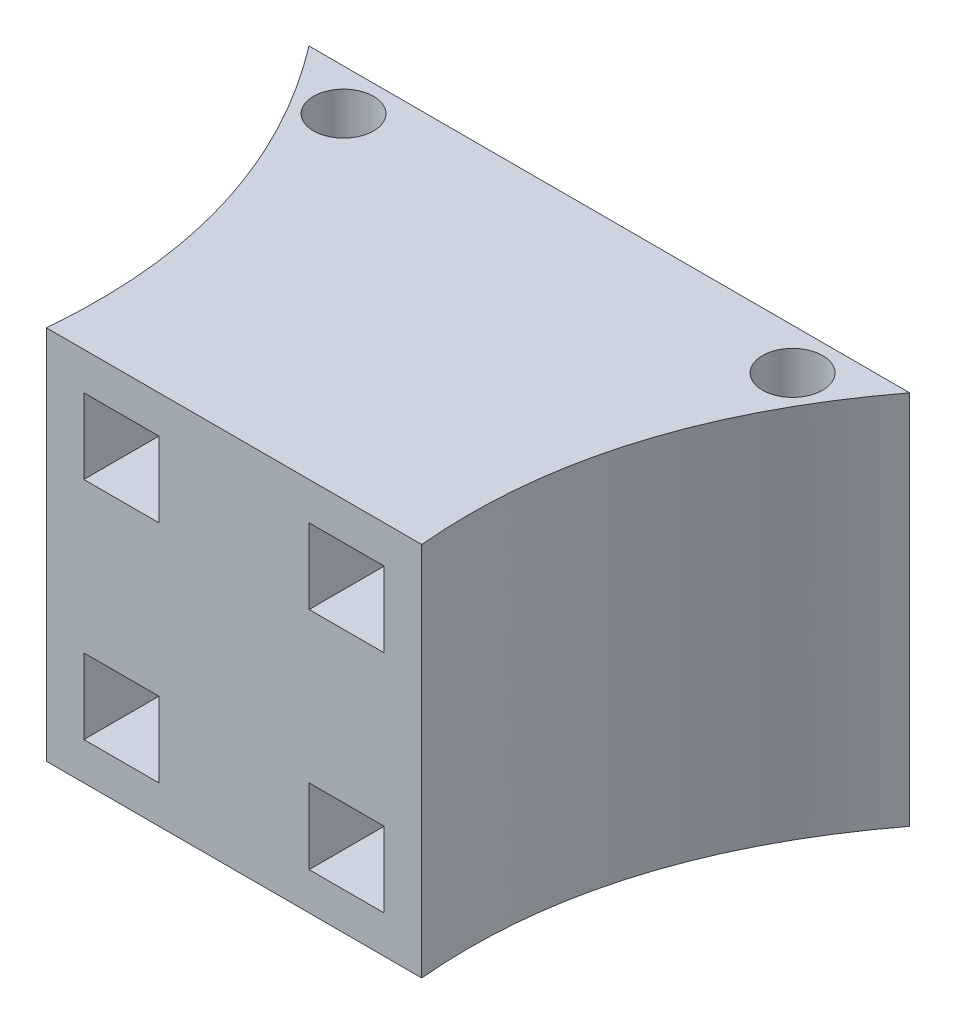
ISO-10303-21;
HEADER;
FILE_DESCRIPTION(('STEP AP214'),'2;1');
FILE_NAME('part.step','',(''),(''),'','','');
FILE_SCHEMA(('AUTOMOTIVE_DESIGN { 1 0 10303 214 1 1 1 1 }'));
ENDSEC;
DATA;
#1=APPLICATION_CONTEXT('core data for automotive mechanical design processes');
#2=APPLICATION_PROTOCOL_DEFINITION('international standard','automotive_design',2000,#1);
#3=PRODUCT_CONTEXT('',#1,'mechanical');
#4=PRODUCT('Part','Part','',(#3));
#5=PRODUCT_RELATED_PRODUCT_CATEGORY('part','',(#4));
#6=PRODUCT_DEFINITION_FORMATION('','',#4);
#7=PRODUCT_DEFINITION_CONTEXT('part definition',#1,'design');
#8=PRODUCT_DEFINITION('design','',#6,#7);
#9=PRODUCT_DEFINITION_SHAPE('','',#8);
#10=(LENGTH_UNIT() NAMED_UNIT(*) SI_UNIT(.MILLI.,.METRE.));
#11=(NAMED_UNIT(*) PLANE_ANGLE_UNIT() SI_UNIT($,.RADIAN.));
#12=(NAMED_UNIT(*) SI_UNIT($,.STERADIAN.) SOLID_ANGLE_UNIT());
#13=UNCERTAINTY_MEASURE_WITH_UNIT(LENGTH_MEASURE(1.E-05),#10,'distance_accuracy_value','');
#14=(GEOMETRIC_REPRESENTATION_CONTEXT(3) GLOBAL_UNCERTAINTY_ASSIGNED_CONTEXT((#13)) GLOBAL_UNIT_ASSIGNED_CONTEXT((#10,
#11,#12)) REPRESENTATION_CONTEXT('',''));
#15=CARTESIAN_POINT('',(0.,0.,0.));
#16=DIRECTION('',(0.,0.,1.));
#17=DIRECTION('',(1.,0.,0.));
#18=AXIS2_PLACEMENT_3D('',#15,#16,#17);
#19=CARTESIAN_POINT('',(-38.1,-127.,-126.964946797341));
#20=CARTESIAN_POINT('',(6.35973064155392,-127.,-68.4699237565732));
#21=CARTESIAN_POINT('',(0.,-127.,0.));
#22=B_SPLINE_CURVE_WITH_KNOTS('',2,(#19,#20,#21),.UNSPECIFIED.,.F.,.F.,(3,3),(0.,1.),.UNSPECIFIED.);
#23=DIRECTION('',(0.,1.,0.));
#24=VECTOR('',#23,1.);
#25=SURFACE_OF_LINEAR_EXTRUSION('',#22,#24);
#26=CARTESIAN_POINT('',(-38.1,0.,-126.964946797341));
#27=CARTESIAN_POINT('',(6.35973064155392,0.,-68.4699237565732));
#28=CARTESIAN_POINT('',(0.,0.,0.));
#29=B_SPLINE_CURVE_WITH_KNOTS('',2,(#26,#27,#28),.UNSPECIFIED.,.F.,.F.,(3,3),(0.,1.),.UNSPECIFIED.);
#30=CARTESIAN_POINT('',(-38.1,0.,-126.964946797341));
#31=VERTEX_POINT('',#30);
#32=CARTESIAN_POINT('',(0.,0.,0.));
#33=VERTEX_POINT('',#32);
#34=EDGE_CURVE('E302',#31,#33,#29,.T.);
#35=ORIENTED_EDGE('',*,*,#34,.F.);
#36=DIRECTION('',(0.,1.,0.));
#37=VECTOR('',#36,1.);
#38=CARTESIAN_POINT('',(-38.1,-127.,-126.964946797341));
#39=LINE('',#38,#37);
#40=CARTESIAN_POINT('',(-38.1,-127.,-126.964946797341));
#41=VERTEX_POINT('',#40);
#42=EDGE_CURVE('E11',#41,#31,#39,.T.);
#43=ORIENTED_EDGE('',*,*,#42,.F.);
#44=CARTESIAN_POINT('',(0.,-127.,0.));
#45=VERTEX_POINT('',#44);
#46=EDGE_CURVE('E308',#41,#45,#22,.T.);
#47=ORIENTED_EDGE('',*,*,#46,.T.);
#48=DIRECTION('',(0.,1.,0.));
#49=VECTOR('',#48,1.);
#50=CARTESIAN_POINT('',(0.,-127.,0.));
#51=LINE('',#50,#49);
#52=EDGE_CURVE('E36',#45,#33,#51,.T.);
#53=ORIENTED_EDGE('',*,*,#52,.T.);
#54=EDGE_LOOP('',(#35,#43,#47,#53));
#55=FACE_BOUND('',#54,.T.);
#56=ADVANCED_FACE('F32',(#55),#25,.T.);
#57=CARTESIAN_POINT('',(165.1,-127.,-126.964946797341));
#58=DIRECTION('',(0.,0.,-1.));
#59=DIRECTION('',(-1.,0.,0.));
#60=AXIS2_PLACEMENT_3D('',#57,#58,#59);
#61=PLANE('',#60);
#62=DIRECTION('',(-1.,0.,0.));
#63=VECTOR('',#62,1.);
#64=CARTESIAN_POINT('',(165.1,0.,-126.964946797341));
#65=LINE('',#64,#63);
#66=CARTESIAN_POINT('',(165.1,0.,-126.964946797341));
#67=VERTEX_POINT('',#66);
#68=EDGE_CURVE('E315',#67,#31,#65,.T.);
#69=ORIENTED_EDGE('',*,*,#68,.F.);
#70=DIRECTION('',(0.,1.,0.));
#71=VECTOR('',#70,1.);
#72=CARTESIAN_POINT('',(165.1,-127.,-126.964946797341));
#73=LINE('',#72,#71);
#74=CARTESIAN_POINT('',(165.1,-127.,-126.964946797341));
#75=VERTEX_POINT('',#74);
#76=EDGE_CURVE('E41',#75,#67,#73,.T.);
#77=ORIENTED_EDGE('',*,*,#76,.F.);
#78=DIRECTION('',(-1.,0.,0.));
#79=VECTOR('',#78,1.);
#80=CARTESIAN_POINT('',(165.1,-127.,-126.964946797341));
#81=LINE('',#80,#79);
#82=EDGE_CURVE('E327',#75,#41,#81,.T.);
#83=ORIENTED_EDGE('',*,*,#82,.T.);
#84=ORIENTED_EDGE('',*,*,#42,.T.);
#85=EDGE_LOOP('',(#69,#77,#83,#84));
#86=FACE_BOUND('',#85,.T.);
#87=ADVANCED_FACE('F337',(#86),#61,.T.);
#88=CARTESIAN_POINT('',(127.,-127.,0.));
#89=CARTESIAN_POINT('',(120.64028038654,-127.,-68.4699193864039));
#90=CARTESIAN_POINT('',(165.1,-127.,-126.964946797341));
#91=B_SPLINE_CURVE_WITH_KNOTS('',2,(#88,#89,#90),.UNSPECIFIED.,.F.,.F.,(3,3),(0.,1.),.UNSPECIFIED.);
#92=DIRECTION('',(0.,1.,0.));
#93=VECTOR('',#92,1.);
#94=SURFACE_OF_LINEAR_EXTRUSION('',#91,#93);
#95=CARTESIAN_POINT('',(127.,0.,0.));
#96=CARTESIAN_POINT('',(120.64028038654,0.,-68.4699193864039));
#97=CARTESIAN_POINT('',(165.1,0.,-126.964946797341));
#98=B_SPLINE_CURVE_WITH_KNOTS('',2,(#95,#96,#97),.UNSPECIFIED.,.F.,.F.,(3,3),(0.,1.),.UNSPECIFIED.);
#99=CARTESIAN_POINT('',(127.,0.,0.));
#100=VERTEX_POINT('',#99);
#101=EDGE_CURVE('E367',#100,#67,#98,.T.);
#102=ORIENTED_EDGE('',*,*,#101,.F.);
#103=DIRECTION('',(0.,1.,0.));
#104=VECTOR('',#103,1.);
#105=CARTESIAN_POINT('',(127.,-127.,0.));
#106=LINE('',#105,#104);
#107=CARTESIAN_POINT('',(127.,-127.,0.));
#108=VERTEX_POINT('',#107);
#109=EDGE_CURVE('E374',#108,#100,#106,.T.);
#110=ORIENTED_EDGE('',*,*,#109,.F.);
#111=EDGE_CURVE('E321',#108,#75,#91,.T.);
#112=ORIENTED_EDGE('',*,*,#111,.T.);
#113=ORIENTED_EDGE('',*,*,#76,.T.);
#114=EDGE_LOOP('',(#102,#110,#112,#113));
#115=FACE_BOUND('',#114,.T.);
#116=ADVANCED_FACE('F333',(#115),#94,.T.);
#117=CARTESIAN_POINT('',(0.,-127.,0.));
#118=DIRECTION('',(0.,0.,1.));
#119=DIRECTION('',(1.,0.,0.));
#120=AXIS2_PLACEMENT_3D('',#117,#118,#119);
#121=PLANE('',#120);
#122=DIRECTION('',(0.,1.,0.));
#123=VECTOR('',#122,1.);
#124=CARTESIAN_POINT('',(38.1,-88.9,0.));
#125=LINE('',#124,#123);
#126=CARTESIAN_POINT('',(38.1,-114.3,0.));
#127=VERTEX_POINT('',#126);
#128=CARTESIAN_POINT('',(38.1,-88.9,0.));
#129=VERTEX_POINT('',#128);
#130=EDGE_CURVE('E49',#127,#129,#125,.T.);
#131=ORIENTED_EDGE('',*,*,#130,.F.);
#132=DIRECTION('',(1.,0.,0.));
#133=VECTOR('',#132,1.);
#134=CARTESIAN_POINT('',(38.1,-114.3,0.));
#135=LINE('',#134,#133);
#136=CARTESIAN_POINT('',(12.7,-114.3,0.));
#137=VERTEX_POINT('',#136);
#138=EDGE_CURVE('E220',#137,#127,#135,.T.);
#139=ORIENTED_EDGE('',*,*,#138,.F.);
#140=DIRECTION('',(0.,-1.,0.));
#141=VECTOR('',#140,1.);
#142=CARTESIAN_POINT('',(12.7,-88.9,0.));
#143=LINE('',#142,#141);
#144=CARTESIAN_POINT('',(12.7,-88.9,0.));
#145=VERTEX_POINT('',#144);
#146=EDGE_CURVE('E235',#145,#137,#143,.T.);
#147=ORIENTED_EDGE('',*,*,#146,.F.);
#148=DIRECTION('',(-1.,0.,0.));
#149=VECTOR('',#148,1.);
#150=CARTESIAN_POINT('',(38.1,-88.9,0.));
#151=LINE('',#150,#149);
#152=EDGE_CURVE('E231',#129,#145,#151,.T.);
#153=ORIENTED_EDGE('',*,*,#152,.F.);
#154=EDGE_LOOP('',(#131,#139,#147,#153));
#155=FACE_BOUND('',#154,.T.);
#156=DIRECTION('',(0.,-1.,0.));
#157=VECTOR('',#156,1.);
#158=CARTESIAN_POINT('',(88.9,-12.7,0.));
#159=LINE('',#158,#157);
#160=CARTESIAN_POINT('',(88.9,-12.7,0.));
#161=VERTEX_POINT('',#160);
#162=CARTESIAN_POINT('',(88.9,-38.1,0.));
#163=VERTEX_POINT('',#162);
#164=EDGE_CURVE('E57',#161,#163,#159,.T.);
#165=ORIENTED_EDGE('',*,*,#164,.F.);
#166=DIRECTION('',(-1.,0.,0.));
#167=VECTOR('',#166,1.);
#168=CARTESIAN_POINT('',(88.9,-12.7,0.));
#169=LINE('',#168,#167);
#170=CARTESIAN_POINT('',(114.3,-12.7,0.));
#171=VERTEX_POINT('',#170);
#172=EDGE_CURVE('E252',#171,#161,#169,.T.);
#173=ORIENTED_EDGE('',*,*,#172,.F.);
#174=DIRECTION('',(0.,1.,0.));
#175=VECTOR('',#174,1.);
#176=CARTESIAN_POINT('',(114.3,-12.7,0.));
#177=LINE('',#176,#175);
#178=CARTESIAN_POINT('',(114.3,-38.1,0.));
#179=VERTEX_POINT('',#178);
#180=EDGE_CURVE('E266',#179,#171,#177,.T.);
#181=ORIENTED_EDGE('',*,*,#180,.F.);
#182=DIRECTION('',(1.,0.,0.));
#183=VECTOR('',#182,1.);
#184=CARTESIAN_POINT('',(88.9,-38.1,0.));
#185=LINE('',#184,#183);
#186=EDGE_CURVE('E263',#163,#179,#185,.T.);
#187=ORIENTED_EDGE('',*,*,#186,.F.);
#188=EDGE_LOOP('',(#165,#173,#181,#187));
#189=FACE_BOUND('',#188,.T.);
#190=DIRECTION('',(0.,-1.,0.));
#191=VECTOR('',#190,1.);
#192=CARTESIAN_POINT('',(88.9,-88.9,0.));
#193=LINE('',#192,#191);
#194=CARTESIAN_POINT('',(88.9,-88.9,0.));
#195=VERTEX_POINT('',#194);
#196=CARTESIAN_POINT('',(88.9,-114.3,0.));
#197=VERTEX_POINT('',#196);
#198=EDGE_CURVE('E177',#195,#197,#193,.T.);
#199=ORIENTED_EDGE('',*,*,#198,.F.);
#200=DIRECTION('',(-1.,0.,0.));
#201=VECTOR('',#200,1.);
#202=CARTESIAN_POINT('',(88.9,-88.9,0.));
#203=LINE('',#202,#201);
#204=CARTESIAN_POINT('',(114.3,-88.9,0.));
#205=VERTEX_POINT('',#204);
#206=EDGE_CURVE('E194',#205,#195,#203,.T.);
#207=ORIENTED_EDGE('',*,*,#206,.F.);
#208=DIRECTION('',(0.,1.,0.));
#209=VECTOR('',#208,1.);
#210=CARTESIAN_POINT('',(114.3,-88.9,0.));
#211=LINE('',#210,#209);
#212=CARTESIAN_POINT('',(114.3,-114.3,0.));
#213=VERTEX_POINT('',#212);
#214=EDGE_CURVE('E197',#213,#205,#211,.T.);
#215=ORIENTED_EDGE('',*,*,#214,.F.);
#216=DIRECTION('',(1.,0.,0.));
#217=VECTOR('',#216,1.);
#218=CARTESIAN_POINT('',(88.9,-114.3,0.));
#219=LINE('',#218,#217);
#220=EDGE_CURVE('E206',#197,#213,#219,.T.);
#221=ORIENTED_EDGE('',*,*,#220,.F.);
#222=EDGE_LOOP('',(#199,#207,#215,#221));
#223=FACE_BOUND('',#222,.T.);
#224=DIRECTION('',(0.,-1.,0.));
#225=VECTOR('',#224,1.);
#226=CARTESIAN_POINT('',(12.7,-12.7,0.));
#227=LINE('',#226,#225);
#228=CARTESIAN_POINT('',(12.7,-12.7,0.));
#229=VERTEX_POINT('',#228);
#230=CARTESIAN_POINT('',(12.7,-38.1,0.));
#231=VERTEX_POINT('',#230);
#232=EDGE_CURVE('E242',#229,#231,#227,.T.);
#233=ORIENTED_EDGE('',*,*,#232,.F.);
#234=DIRECTION('',(-1.,0.,0.));
#235=VECTOR('',#234,1.);
#236=CARTESIAN_POINT('',(12.7,-12.7,0.));
#237=LINE('',#236,#235);
#238=CARTESIAN_POINT('',(38.1,-12.7,0.));
#239=VERTEX_POINT('',#238);
#240=EDGE_CURVE('E281',#239,#229,#237,.T.);
#241=ORIENTED_EDGE('',*,*,#240,.F.);
#242=DIRECTION('',(0.,1.,0.));
#243=VECTOR('',#242,1.);
#244=CARTESIAN_POINT('',(38.1,-12.7,0.));
#245=LINE('',#244,#243);
#246=CARTESIAN_POINT('',(38.1,-38.1,0.));
#247=VERTEX_POINT('',#246);
#248=EDGE_CURVE('E295',#247,#239,#245,.T.);
#249=ORIENTED_EDGE('',*,*,#248,.F.);
#250=DIRECTION('',(1.,0.,0.));
#251=VECTOR('',#250,1.);
#252=CARTESIAN_POINT('',(12.7,-38.1,0.));
#253=LINE('',#252,#251);
#254=EDGE_CURVE('E292',#231,#247,#253,.T.);
#255=ORIENTED_EDGE('',*,*,#254,.F.);
#256=EDGE_LOOP('',(#233,#241,#249,#255));
#257=FACE_BOUND('',#256,.T.);
#258=DIRECTION('',(1.,0.,0.));
#259=VECTOR('',#258,1.);
#260=CARTESIAN_POINT('',(0.,0.,0.));
#261=LINE('',#260,#259);
#262=EDGE_CURVE('E363',#33,#100,#261,.T.);
#263=ORIENTED_EDGE('',*,*,#262,.F.);
#264=ORIENTED_EDGE('',*,*,#52,.F.);
#265=DIRECTION('',(1.,0.,0.));
#266=VECTOR('',#265,1.);
#267=CARTESIAN_POINT('',(0.,-127.,0.));
#268=LINE('',#267,#266);
#269=EDGE_CURVE('E314',#45,#108,#268,.T.);
#270=ORIENTED_EDGE('',*,*,#269,.T.);
#271=ORIENTED_EDGE('',*,*,#109,.T.);
#272=EDGE_LOOP('',(#263,#264,#270,#271));
#273=FACE_BOUND('',#272,.T.);
#274=ADVANCED_FACE('F336',(#155,#189,#223,#257,#273),#121,.T.);
#275=CARTESIAN_POINT('',(-6.34513467922304,-127.,-65.9761985776217));
#276=DIRECTION('',(0.,-1.,0.));
#277=DIRECTION('',(0.,0.,-1.));
#278=AXIS2_PLACEMENT_3D('',#275,#276,#277);
#279=PLANE('',#278);
#280=CARTESIAN_POINT('',(-12.4472574565603,-127.,-112.994946797341));
#281=DIRECTION('',(0.,1.,0.));
#282=DIRECTION('',(0.,0.,1.));
#283=AXIS2_PLACEMENT_3D('',#280,#281,#282);
#284=CIRCLE('',#283,10.16);
#285=CARTESIAN_POINT('',(-12.4472574565603,-127.,-102.834946797341));
#286=VERTEX_POINT('',#285);
#287=EDGE_CURVE('E207',#286,#286,#284,.T.);
#288=ORIENTED_EDGE('',*,*,#287,.T.);
#289=EDGE_LOOP('',(#288));
#290=FACE_BOUND('',#289,.T.);
#291=CARTESIAN_POINT('',(139.44725745656,-127.,-112.994946797341));
#292=DIRECTION('',(0.,1.,0.));
#293=DIRECTION('',(0.,0.,1.));
#294=AXIS2_PLACEMENT_3D('',#291,#292,#293);
#295=CIRCLE('',#294,10.16);
#296=CARTESIAN_POINT('',(139.44725745656,-127.,-102.834946797341));
#297=VERTEX_POINT('',#296);
#298=EDGE_CURVE('E482',#297,#297,#295,.T.);
#299=ORIENTED_EDGE('',*,*,#298,.T.);
#300=EDGE_LOOP('',(#299));
#301=FACE_BOUND('',#300,.T.);
#302=ORIENTED_EDGE('',*,*,#46,.F.);
#303=ORIENTED_EDGE('',*,*,#82,.F.);
#304=ORIENTED_EDGE('',*,*,#111,.F.);
#305=ORIENTED_EDGE('',*,*,#269,.F.);
#306=EDGE_LOOP('',(#302,#303,#304,#305));
#307=FACE_BOUND('',#306,.T.);
#308=ADVANCED_FACE('F341',(#290,#301,#307),#279,.T.);
#309=CARTESIAN_POINT('',(-6.34513467922304,0.,-65.9761985776217));
#310=DIRECTION('',(0.,-1.,0.));
#311=DIRECTION('',(0.,0.,-1.));
#312=AXIS2_PLACEMENT_3D('',#309,#310,#311);
#313=PLANE('',#312);
#314=CARTESIAN_POINT('',(-12.4472574565603,0.,-112.994946797341));
#315=DIRECTION('',(0.,1.,0.));
#316=DIRECTION('',(0.,0.,1.));
#317=AXIS2_PLACEMENT_3D('',#314,#315,#316);
#318=CIRCLE('',#317,10.16);
#319=CARTESIAN_POINT('',(-12.4472574565603,0.,-102.834946797341));
#320=VERTEX_POINT('',#319);
#321=EDGE_CURVE('E481',#320,#320,#318,.T.);
#322=ORIENTED_EDGE('',*,*,#321,.F.);
#323=EDGE_LOOP('',(#322));
#324=FACE_BOUND('',#323,.T.);
#325=CARTESIAN_POINT('',(139.44725745656,0.,-112.994946797341));
#326=DIRECTION('',(0.,1.,0.));
#327=DIRECTION('',(0.,0.,1.));
#328=AXIS2_PLACEMENT_3D('',#325,#326,#327);
#329=CIRCLE('',#328,10.16);
#330=CARTESIAN_POINT('',(139.44725745656,0.,-102.834946797341));
#331=VERTEX_POINT('',#330);
#332=EDGE_CURVE('E200',#331,#331,#329,.T.);
#333=ORIENTED_EDGE('',*,*,#332,.F.);
#334=EDGE_LOOP('',(#333));
#335=FACE_BOUND('',#334,.T.);
#336=ORIENTED_EDGE('',*,*,#34,.T.);
#337=ORIENTED_EDGE('',*,*,#262,.T.);
#338=ORIENTED_EDGE('',*,*,#101,.T.);
#339=ORIENTED_EDGE('',*,*,#68,.T.);
#340=EDGE_LOOP('',(#336,#337,#338,#339));
#341=FACE_BOUND('',#340,.T.);
#342=ADVANCED_FACE('F346',(#324,#335,#341),#313,.F.);
#343=CARTESIAN_POINT('',(12.7,-12.7,-63.5));
#344=DIRECTION('',(-1.,0.,0.));
#345=DIRECTION('',(0.,-1.,0.));
#346=AXIS2_PLACEMENT_3D('',#343,#344,#345);
#347=PLANE('',#346);
#348=ORIENTED_EDGE('',*,*,#232,.T.);
#349=DIRECTION('',(0.,0.,1.));
#350=VECTOR('',#349,1.);
#351=CARTESIAN_POINT('',(12.7,-38.1,-63.5));
#352=LINE('',#351,#350);
#353=CARTESIAN_POINT('',(12.7,-38.1,-63.5));
#354=VERTEX_POINT('',#353);
#355=EDGE_CURVE('E290',#354,#231,#352,.T.);
#356=ORIENTED_EDGE('',*,*,#355,.F.);
#357=DIRECTION('',(0.,-1.,0.));
#358=VECTOR('',#357,1.);
#359=CARTESIAN_POINT('',(12.7,-12.7,-63.5));
#360=LINE('',#359,#358);
#361=CARTESIAN_POINT('',(12.7,-12.7,-63.5));
#362=VERTEX_POINT('',#361);
#363=EDGE_CURVE('E277',#362,#354,#360,.T.);
#364=ORIENTED_EDGE('',*,*,#363,.F.);
#365=DIRECTION('',(0.,0.,1.));
#366=VECTOR('',#365,1.);
#367=CARTESIAN_POINT('',(12.7,-12.7,-63.5));
#368=LINE('',#367,#366);
#369=EDGE_CURVE('E300',#362,#229,#368,.T.);
#370=ORIENTED_EDGE('',*,*,#369,.T.);
#371=EDGE_LOOP('',(#348,#356,#364,#370));
#372=FACE_BOUND('',#371,.T.);
#373=ADVANCED_FACE('F390',(#372),#347,.F.);
#374=CARTESIAN_POINT('',(12.7,-12.7,-63.5));
#375=DIRECTION('',(0.,1.,0.));
#376=DIRECTION('',(0.,0.,1.));
#377=AXIS2_PLACEMENT_3D('',#374,#375,#376);
#378=PLANE('',#377);
#379=ORIENTED_EDGE('',*,*,#240,.T.);
#380=ORIENTED_EDGE('',*,*,#369,.F.);
#381=DIRECTION('',(-1.,0.,0.));
#382=VECTOR('',#381,1.);
#383=CARTESIAN_POINT('',(12.7,-12.7,-63.5));
#384=LINE('',#383,#382);
#385=CARTESIAN_POINT('',(38.1,-12.7,-63.5));
#386=VERTEX_POINT('',#385);
#387=EDGE_CURVE('E287',#386,#362,#384,.T.);
#388=ORIENTED_EDGE('',*,*,#387,.F.);
#389=DIRECTION('',(0.,0.,1.));
#390=VECTOR('',#389,1.);
#391=CARTESIAN_POINT('',(38.1,-12.7,-63.5));
#392=LINE('',#391,#390);
#393=EDGE_CURVE('E303',#386,#239,#392,.T.);
#394=ORIENTED_EDGE('',*,*,#393,.T.);
#395=EDGE_LOOP('',(#379,#380,#388,#394));
#396=FACE_BOUND('',#395,.T.);
#397=ADVANCED_FACE('F395',(#396),#378,.F.);
#398=CARTESIAN_POINT('',(38.1,-12.7,-63.5));
#399=DIRECTION('',(1.,0.,0.));
#400=DIRECTION('',(0.,1.,0.));
#401=AXIS2_PLACEMENT_3D('',#398,#399,#400);
#402=PLANE('',#401);
#403=ORIENTED_EDGE('',*,*,#248,.T.);
#404=ORIENTED_EDGE('',*,*,#393,.F.);
#405=DIRECTION('',(0.,1.,0.));
#406=VECTOR('',#405,1.);
#407=CARTESIAN_POINT('',(38.1,-12.7,-63.5));
#408=LINE('',#407,#406);
#409=CARTESIAN_POINT('',(38.1,-38.1,-63.5));
#410=VERTEX_POINT('',#409);
#411=EDGE_CURVE('E284',#410,#386,#408,.T.);
#412=ORIENTED_EDGE('',*,*,#411,.F.);
#413=DIRECTION('',(0.,0.,1.));
#414=VECTOR('',#413,1.);
#415=CARTESIAN_POINT('',(38.1,-38.1,-63.5));
#416=LINE('',#415,#414);
#417=EDGE_CURVE('E305',#410,#247,#416,.T.);
#418=ORIENTED_EDGE('',*,*,#417,.T.);
#419=EDGE_LOOP('',(#403,#404,#412,#418));
#420=FACE_BOUND('',#419,.T.);
#421=ADVANCED_FACE('F405',(#420),#402,.F.);
#422=CARTESIAN_POINT('',(12.7,-38.1,-63.5));
#423=DIRECTION('',(0.,-1.,0.));
#424=DIRECTION('',(0.,0.,-1.));
#425=AXIS2_PLACEMENT_3D('',#422,#423,#424);
#426=PLANE('',#425);
#427=ORIENTED_EDGE('',*,*,#254,.T.);
#428=ORIENTED_EDGE('',*,*,#417,.F.);
#429=DIRECTION('',(1.,0.,0.));
#430=VECTOR('',#429,1.);
#431=CARTESIAN_POINT('',(12.7,-38.1,-63.5));
#432=LINE('',#431,#430);
#433=EDGE_CURVE('E280',#354,#410,#432,.T.);
#434=ORIENTED_EDGE('',*,*,#433,.F.);
#435=ORIENTED_EDGE('',*,*,#355,.T.);
#436=EDGE_LOOP('',(#427,#428,#434,#435));
#437=FACE_BOUND('',#436,.T.);
#438=ADVANCED_FACE('F401',(#437),#426,.F.);
#439=CARTESIAN_POINT('',(0.,0.,-63.5));
#440=DIRECTION('',(0.,0.,1.));
#441=DIRECTION('',(1.,0.,0.));
#442=AXIS2_PLACEMENT_3D('',#439,#440,#441);
#443=PLANE('',#442);
#444=ORIENTED_EDGE('',*,*,#363,.T.);
#445=ORIENTED_EDGE('',*,*,#433,.T.);
#446=ORIENTED_EDGE('',*,*,#411,.T.);
#447=ORIENTED_EDGE('',*,*,#387,.T.);
#448=EDGE_LOOP('',(#444,#445,#446,#447));
#449=FACE_BOUND('',#448,.T.);
#450=ADVANCED_FACE('F404',(#449),#443,.T.);
#451=CARTESIAN_POINT('',(88.9,-88.9,-63.5));
#452=DIRECTION('',(-1.,0.,0.));
#453=DIRECTION('',(0.,0.,1.));
#454=AXIS2_PLACEMENT_3D('',#451,#452,#453);
#455=PLANE('',#454);
#456=ORIENTED_EDGE('',*,*,#198,.T.);
#457=DIRECTION('',(0.,0.,1.));
#458=VECTOR('',#457,1.);
#459=CARTESIAN_POINT('',(88.9,-114.3,-63.5));
#460=LINE('',#459,#458);
#461=CARTESIAN_POINT('',(88.9,-114.3,-63.5));
#462=VERTEX_POINT('',#461);
#463=EDGE_CURVE('E170',#462,#197,#460,.T.);
#464=ORIENTED_EDGE('',*,*,#463,.F.);
#465=DIRECTION('',(0.,-1.,0.));
#466=VECTOR('',#465,1.);
#467=CARTESIAN_POINT('',(88.9,-88.9,-63.5));
#468=LINE('',#467,#466);
#469=CARTESIAN_POINT('',(88.9,-88.9,-63.5));
#470=VERTEX_POINT('',#469);
#471=EDGE_CURVE('E174',#470,#462,#468,.T.);
#472=ORIENTED_EDGE('',*,*,#471,.F.);
#473=DIRECTION('',(0.,0.,1.));
#474=VECTOR('',#473,1.);
#475=CARTESIAN_POINT('',(88.9,-88.9,-63.5));
#476=LINE('',#475,#474);
#477=EDGE_CURVE('E211',#470,#195,#476,.T.);
#478=ORIENTED_EDGE('',*,*,#477,.T.);
#479=EDGE_LOOP('',(#456,#464,#472,#478));
#480=FACE_BOUND('',#479,.T.);
#481=ADVANCED_FACE('F172',(#480),#455,.F.);
#482=CARTESIAN_POINT('',(88.9,-88.9,-63.5));
#483=DIRECTION('',(0.,1.,0.));
#484=DIRECTION('',(0.,0.,1.));
#485=AXIS2_PLACEMENT_3D('',#482,#483,#484);
#486=PLANE('',#485);
#487=ORIENTED_EDGE('',*,*,#206,.T.);
#488=ORIENTED_EDGE('',*,*,#477,.F.);
#489=DIRECTION('',(-1.,0.,0.));
#490=VECTOR('',#489,1.);
#491=CARTESIAN_POINT('',(88.9,-88.9,-63.5));
#492=LINE('',#491,#490);
#493=CARTESIAN_POINT('',(114.3,-88.9,-63.5));
#494=VERTEX_POINT('',#493);
#495=EDGE_CURVE('E182',#494,#470,#492,.T.);
#496=ORIENTED_EDGE('',*,*,#495,.F.);
#497=DIRECTION('',(0.,0.,1.));
#498=VECTOR('',#497,1.);
#499=CARTESIAN_POINT('',(114.3,-88.9,-63.5));
#500=LINE('',#499,#498);
#501=EDGE_CURVE('E213',#494,#205,#500,.T.);
#502=ORIENTED_EDGE('',*,*,#501,.T.);
#503=EDGE_LOOP('',(#487,#488,#496,#502));
#504=FACE_BOUND('',#503,.T.);
#505=ADVANCED_FACE('F457',(#504),#486,.F.);
#506=CARTESIAN_POINT('',(114.3,-88.9,-63.5));
#507=DIRECTION('',(1.,0.,0.));
#508=DIRECTION('',(0.,1.,0.));
#509=AXIS2_PLACEMENT_3D('',#506,#507,#508);
#510=PLANE('',#509);
#511=ORIENTED_EDGE('',*,*,#214,.T.);
#512=ORIENTED_EDGE('',*,*,#501,.F.);
#513=DIRECTION('',(0.,1.,0.));
#514=VECTOR('',#513,1.);
#515=CARTESIAN_POINT('',(114.3,-88.9,-63.5));
#516=LINE('',#515,#514);
#517=CARTESIAN_POINT('',(114.3,-114.3,-63.5));
#518=VERTEX_POINT('',#517);
#519=EDGE_CURVE('E190',#518,#494,#516,.T.);
#520=ORIENTED_EDGE('',*,*,#519,.F.);
#521=DIRECTION('',(0.,0.,1.));
#522=VECTOR('',#521,1.);
#523=CARTESIAN_POINT('',(114.3,-114.3,-63.5));
#524=LINE('',#523,#522);
#525=EDGE_CURVE('E181',#518,#213,#524,.T.);
#526=ORIENTED_EDGE('',*,*,#525,.T.);
#527=EDGE_LOOP('',(#511,#512,#520,#526));
#528=FACE_BOUND('',#527,.T.);
#529=ADVANCED_FACE('F460',(#528),#510,.F.);
#530=CARTESIAN_POINT('',(88.9,-114.3,-63.5));
#531=DIRECTION('',(0.,-1.,0.));
#532=DIRECTION('',(0.,0.,-1.));
#533=AXIS2_PLACEMENT_3D('',#530,#531,#532);
#534=PLANE('',#533);
#535=ORIENTED_EDGE('',*,*,#220,.T.);
#536=ORIENTED_EDGE('',*,*,#525,.F.);
#537=DIRECTION('',(1.,0.,0.));
#538=VECTOR('',#537,1.);
#539=CARTESIAN_POINT('',(88.9,-114.3,-63.5));
#540=LINE('',#539,#538);
#541=EDGE_CURVE('E185',#462,#518,#540,.T.);
#542=ORIENTED_EDGE('',*,*,#541,.F.);
#543=ORIENTED_EDGE('',*,*,#463,.T.);
#544=EDGE_LOOP('',(#535,#536,#542,#543));
#545=FACE_BOUND('',#544,.T.);
#546=ADVANCED_FACE('F186',(#545),#534,.F.);
#547=CARTESIAN_POINT('',(0.,0.,-63.5));
#548=DIRECTION('',(0.,0.,1.));
#549=DIRECTION('',(1.,0.,0.));
#550=AXIS2_PLACEMENT_3D('',#547,#548,#549);
#551=PLANE('',#550);
#552=ORIENTED_EDGE('',*,*,#471,.T.);
#553=ORIENTED_EDGE('',*,*,#541,.T.);
#554=ORIENTED_EDGE('',*,*,#519,.T.);
#555=ORIENTED_EDGE('',*,*,#495,.T.);
#556=EDGE_LOOP('',(#552,#553,#554,#555));
#557=FACE_BOUND('',#556,.T.);
#558=ADVANCED_FACE('F192',(#557),#551,.T.);
#559=CARTESIAN_POINT('',(88.9,-12.7,-63.5));
#560=DIRECTION('',(-1.,0.,0.));
#561=DIRECTION('',(0.,0.,1.));
#562=AXIS2_PLACEMENT_3D('',#559,#560,#561);
#563=PLANE('',#562);
#564=ORIENTED_EDGE('',*,*,#164,.T.);
#565=DIRECTION('',(0.,0.,1.));
#566=VECTOR('',#565,1.);
#567=CARTESIAN_POINT('',(88.9,-38.1,-63.5));
#568=LINE('',#567,#566);
#569=CARTESIAN_POINT('',(88.9,-38.1,-63.5));
#570=VERTEX_POINT('',#569);
#571=EDGE_CURVE('E261',#570,#163,#568,.T.);
#572=ORIENTED_EDGE('',*,*,#571,.F.);
#573=DIRECTION('',(0.,-1.,0.));
#574=VECTOR('',#573,1.);
#575=CARTESIAN_POINT('',(88.9,-12.7,-63.5));
#576=LINE('',#575,#574);
#577=CARTESIAN_POINT('',(88.9,-12.7,-63.5));
#578=VERTEX_POINT('',#577);
#579=EDGE_CURVE('E248',#578,#570,#576,.T.);
#580=ORIENTED_EDGE('',*,*,#579,.F.);
#581=DIRECTION('',(0.,0.,1.));
#582=VECTOR('',#581,1.);
#583=CARTESIAN_POINT('',(88.9,-12.7,-63.5));
#584=LINE('',#583,#582);
#585=EDGE_CURVE('E232',#578,#161,#584,.T.);
#586=ORIENTED_EDGE('',*,*,#585,.T.);
#587=EDGE_LOOP('',(#564,#572,#580,#586));
#588=FACE_BOUND('',#587,.T.);
#589=ADVANCED_FACE('F416',(#588),#563,.F.);
#590=CARTESIAN_POINT('',(88.9,-12.7,-63.5));
#591=DIRECTION('',(0.,1.,0.));
#592=DIRECTION('',(0.,0.,1.));
#593=AXIS2_PLACEMENT_3D('',#590,#591,#592);
#594=PLANE('',#593);
#595=ORIENTED_EDGE('',*,*,#172,.T.);
#596=ORIENTED_EDGE('',*,*,#585,.F.);
#597=DIRECTION('',(-1.,0.,0.));
#598=VECTOR('',#597,1.);
#599=CARTESIAN_POINT('',(88.9,-12.7,-63.5));
#600=LINE('',#599,#598);
#601=CARTESIAN_POINT('',(114.3,-12.7,-63.5));
#602=VERTEX_POINT('',#601);
#603=EDGE_CURVE('E258',#602,#578,#600,.T.);
#604=ORIENTED_EDGE('',*,*,#603,.F.);
#605=DIRECTION('',(0.,0.,1.));
#606=VECTOR('',#605,1.);
#607=CARTESIAN_POINT('',(114.3,-12.7,-63.5));
#608=LINE('',#607,#606);
#609=EDGE_CURVE('E272',#602,#171,#608,.T.);
#610=ORIENTED_EDGE('',*,*,#609,.T.);
#611=EDGE_LOOP('',(#595,#596,#604,#610));
#612=FACE_BOUND('',#611,.T.);
#613=ADVANCED_FACE('F419',(#612),#594,.F.);
#614=CARTESIAN_POINT('',(114.3,-12.7,-63.5));
#615=DIRECTION('',(1.,0.,0.));
#616=DIRECTION('',(0.,0.,-1.));
#617=AXIS2_PLACEMENT_3D('',#614,#615,#616);
#618=PLANE('',#617);
#619=ORIENTED_EDGE('',*,*,#180,.T.);
#620=ORIENTED_EDGE('',*,*,#609,.F.);
#621=DIRECTION('',(0.,1.,0.));
#622=VECTOR('',#621,1.);
#623=CARTESIAN_POINT('',(114.3,-12.7,-63.5));
#624=LINE('',#623,#622);
#625=CARTESIAN_POINT('',(114.3,-38.1,-63.5));
#626=VERTEX_POINT('',#625);
#627=EDGE_CURVE('E255',#626,#602,#624,.T.);
#628=ORIENTED_EDGE('',*,*,#627,.F.);
#629=DIRECTION('',(0.,0.,1.));
#630=VECTOR('',#629,1.);
#631=CARTESIAN_POINT('',(114.3,-38.1,-63.5));
#632=LINE('',#631,#630);
#633=EDGE_CURVE('E274',#626,#179,#632,.T.);
#634=ORIENTED_EDGE('',*,*,#633,.T.);
#635=EDGE_LOOP('',(#619,#620,#628,#634));
#636=FACE_BOUND('',#635,.T.);
#637=ADVANCED_FACE('F424',(#636),#618,.F.);
#638=CARTESIAN_POINT('',(88.9,-38.1,-63.5));
#639=DIRECTION('',(0.,-1.,0.));
#640=DIRECTION('',(0.,0.,-1.));
#641=AXIS2_PLACEMENT_3D('',#638,#639,#640);
#642=PLANE('',#641);
#643=ORIENTED_EDGE('',*,*,#186,.T.);
#644=ORIENTED_EDGE('',*,*,#633,.F.);
#645=DIRECTION('',(1.,0.,0.));
#646=VECTOR('',#645,1.);
#647=CARTESIAN_POINT('',(88.9,-38.1,-63.5));
#648=LINE('',#647,#646);
#649=EDGE_CURVE('E251',#570,#626,#648,.T.);
#650=ORIENTED_EDGE('',*,*,#649,.F.);
#651=ORIENTED_EDGE('',*,*,#571,.T.);
#652=EDGE_LOOP('',(#643,#644,#650,#651));
#653=FACE_BOUND('',#652,.T.);
#654=ADVANCED_FACE('F420',(#653),#642,.F.);
#655=CARTESIAN_POINT('',(0.,0.,-63.5));
#656=DIRECTION('',(0.,0.,1.));
#657=DIRECTION('',(1.,0.,0.));
#658=AXIS2_PLACEMENT_3D('',#655,#656,#657);
#659=PLANE('',#658);
#660=ORIENTED_EDGE('',*,*,#579,.T.);
#661=ORIENTED_EDGE('',*,*,#649,.T.);
#662=ORIENTED_EDGE('',*,*,#627,.T.);
#663=ORIENTED_EDGE('',*,*,#603,.T.);
#664=EDGE_LOOP('',(#660,#661,#662,#663));
#665=FACE_BOUND('',#664,.T.);
#666=ADVANCED_FACE('F423',(#665),#659,.T.);
#667=CARTESIAN_POINT('',(38.1,-88.9,-63.5));
#668=DIRECTION('',(1.,0.,0.));
#669=DIRECTION('',(0.,0.,-1.));
#670=AXIS2_PLACEMENT_3D('',#667,#668,#669);
#671=PLANE('',#670);
#672=ORIENTED_EDGE('',*,*,#130,.T.);
#673=DIRECTION('',(0.,0.,1.));
#674=VECTOR('',#673,1.);
#675=CARTESIAN_POINT('',(38.1,-88.9,-63.5));
#676=LINE('',#675,#674);
#677=CARTESIAN_POINT('',(38.1,-88.9,-63.5));
#678=VERTEX_POINT('',#677);
#679=EDGE_CURVE('E229',#678,#129,#676,.T.);
#680=ORIENTED_EDGE('',*,*,#679,.F.);
#681=DIRECTION('',(0.,1.,0.));
#682=VECTOR('',#681,1.);
#683=CARTESIAN_POINT('',(38.1,-88.9,-63.5));
#684=LINE('',#683,#682);
#685=CARTESIAN_POINT('',(38.1,-114.3,-63.5));
#686=VERTEX_POINT('',#685);
#687=EDGE_CURVE('E216',#686,#678,#684,.T.);
#688=ORIENTED_EDGE('',*,*,#687,.F.);
#689=DIRECTION('',(0.,0.,1.));
#690=VECTOR('',#689,1.);
#691=CARTESIAN_POINT('',(38.1,-114.3,-63.5));
#692=LINE('',#691,#690);
#693=EDGE_CURVE('E240',#686,#127,#692,.T.);
#694=ORIENTED_EDGE('',*,*,#693,.T.);
#695=EDGE_LOOP('',(#672,#680,#688,#694));
#696=FACE_BOUND('',#695,.T.);
#697=ADVANCED_FACE('F434',(#696),#671,.F.);
#698=CARTESIAN_POINT('',(38.1,-114.3,-63.5));
#699=DIRECTION('',(0.,-1.,0.));
#700=DIRECTION('',(0.,0.,-1.));
#701=AXIS2_PLACEMENT_3D('',#698,#699,#700);
#702=PLANE('',#701);
#703=ORIENTED_EDGE('',*,*,#138,.T.);
#704=ORIENTED_EDGE('',*,*,#693,.F.);
#705=DIRECTION('',(1.,0.,0.));
#706=VECTOR('',#705,1.);
#707=CARTESIAN_POINT('',(38.1,-114.3,-63.5));
#708=LINE('',#707,#706);
#709=CARTESIAN_POINT('',(12.7,-114.3,-63.5));
#710=VERTEX_POINT('',#709);
#711=EDGE_CURVE('E226',#710,#686,#708,.T.);
#712=ORIENTED_EDGE('',*,*,#711,.F.);
#713=DIRECTION('',(0.,0.,1.));
#714=VECTOR('',#713,1.);
#715=CARTESIAN_POINT('',(12.7,-114.3,-63.5));
#716=LINE('',#715,#714);
#717=EDGE_CURVE('E243',#710,#137,#716,.T.);
#718=ORIENTED_EDGE('',*,*,#717,.T.);
#719=EDGE_LOOP('',(#703,#704,#712,#718));
#720=FACE_BOUND('',#719,.T.);
#721=ADVANCED_FACE('F438',(#720),#702,.F.);
#722=CARTESIAN_POINT('',(12.7,-88.9,-63.5));
#723=DIRECTION('',(-1.,0.,0.));
#724=DIRECTION('',(0.,-1.,0.));
#725=AXIS2_PLACEMENT_3D('',#722,#723,#724);
#726=PLANE('',#725);
#727=ORIENTED_EDGE('',*,*,#146,.T.);
#728=ORIENTED_EDGE('',*,*,#717,.F.);
#729=DIRECTION('',(0.,-1.,0.));
#730=VECTOR('',#729,1.);
#731=CARTESIAN_POINT('',(12.7,-88.9,-63.5));
#732=LINE('',#731,#730);
#733=CARTESIAN_POINT('',(12.7,-88.9,-63.5));
#734=VERTEX_POINT('',#733);
#735=EDGE_CURVE('E223',#734,#710,#732,.T.);
#736=ORIENTED_EDGE('',*,*,#735,.F.);
#737=DIRECTION('',(0.,0.,1.));
#738=VECTOR('',#737,1.);
#739=CARTESIAN_POINT('',(12.7,-88.9,-63.5));
#740=LINE('',#739,#738);
#741=EDGE_CURVE('E245',#734,#145,#740,.T.);
#742=ORIENTED_EDGE('',*,*,#741,.T.);
#743=EDGE_LOOP('',(#727,#728,#736,#742));
#744=FACE_BOUND('',#743,.T.);
#745=ADVANCED_FACE('F443',(#744),#726,.F.);
#746=CARTESIAN_POINT('',(38.1,-88.9,-63.5));
#747=DIRECTION('',(0.,1.,0.));
#748=DIRECTION('',(0.,0.,1.));
#749=AXIS2_PLACEMENT_3D('',#746,#747,#748);
#750=PLANE('',#749);
#751=ORIENTED_EDGE('',*,*,#152,.T.);
#752=ORIENTED_EDGE('',*,*,#741,.F.);
#753=DIRECTION('',(-1.,0.,0.));
#754=VECTOR('',#753,1.);
#755=CARTESIAN_POINT('',(38.1,-88.9,-63.5));
#756=LINE('',#755,#754);
#757=EDGE_CURVE('E219',#678,#734,#756,.T.);
#758=ORIENTED_EDGE('',*,*,#757,.F.);
#759=ORIENTED_EDGE('',*,*,#679,.T.);
#760=EDGE_LOOP('',(#751,#752,#758,#759));
#761=FACE_BOUND('',#760,.T.);
#762=ADVANCED_FACE('F439',(#761),#750,.F.);
#763=CARTESIAN_POINT('',(0.,0.,-63.5));
#764=DIRECTION('',(0.,0.,-1.));
#765=DIRECTION('',(-1.,0.,0.));
#766=AXIS2_PLACEMENT_3D('',#763,#764,#765);
#767=PLANE('',#766);
#768=ORIENTED_EDGE('',*,*,#687,.T.);
#769=ORIENTED_EDGE('',*,*,#757,.T.);
#770=ORIENTED_EDGE('',*,*,#735,.T.);
#771=ORIENTED_EDGE('',*,*,#711,.T.);
#772=EDGE_LOOP('',(#768,#769,#770,#771));
#773=FACE_BOUND('',#772,.T.);
#774=ADVANCED_FACE('F442',(#773),#767,.F.);
#775=CARTESIAN_POINT('',(139.44725745656,-127.,-112.994946797341));
#776=DIRECTION('',(0.,1.,0.));
#777=DIRECTION('',(0.,0.,1.));
#778=AXIS2_PLACEMENT_3D('',#775,#776,#777);
#779=CYLINDRICAL_SURFACE('',#778,10.16);
#780=ORIENTED_EDGE('',*,*,#298,.F.);
#781=EDGE_LOOP('',(#780));
#782=FACE_BOUND('',#781,.T.);
#783=ORIENTED_EDGE('',*,*,#332,.T.);
#784=EDGE_LOOP('',(#783));
#785=FACE_BOUND('',#784,.T.);
#786=ADVANCED_FACE('F453',(#782,#785),#779,.F.);
#787=CARTESIAN_POINT('',(-12.4472574565603,-127.,-112.994946797341));
#788=DIRECTION('',(0.,1.,0.));
#789=DIRECTION('',(0.,0.,1.));
#790=AXIS2_PLACEMENT_3D('',#787,#788,#789);
#791=CYLINDRICAL_SURFACE('',#790,10.16);
#792=ORIENTED_EDGE('',*,*,#287,.F.);
#793=EDGE_LOOP('',(#792));
#794=FACE_BOUND('',#793,.T.);
#795=ORIENTED_EDGE('',*,*,#321,.T.);
#796=EDGE_LOOP('',(#795));
#797=FACE_BOUND('',#796,.T.);
#798=ADVANCED_FACE('F471',(#794,#797),#791,.F.);
#799=CLOSED_SHELL('',(#56,#87,#116,#274,#308,#342,#373,#397,#421,#438,#450,#481,#505,#529,#546,
#558,#589,#613,#637,#654,#666,#697,#721,#745,#762,#774,#786,#798));
#800=MANIFOLD_SOLID_BREP('B2',#799);
#801=ADVANCED_BREP_SHAPE_REPRESENTATION('',(#18,#800),#14);
#802=SHAPE_DEFINITION_REPRESENTATION(#9,#801);
ENDSEC;
END-ISO-10303-21;
